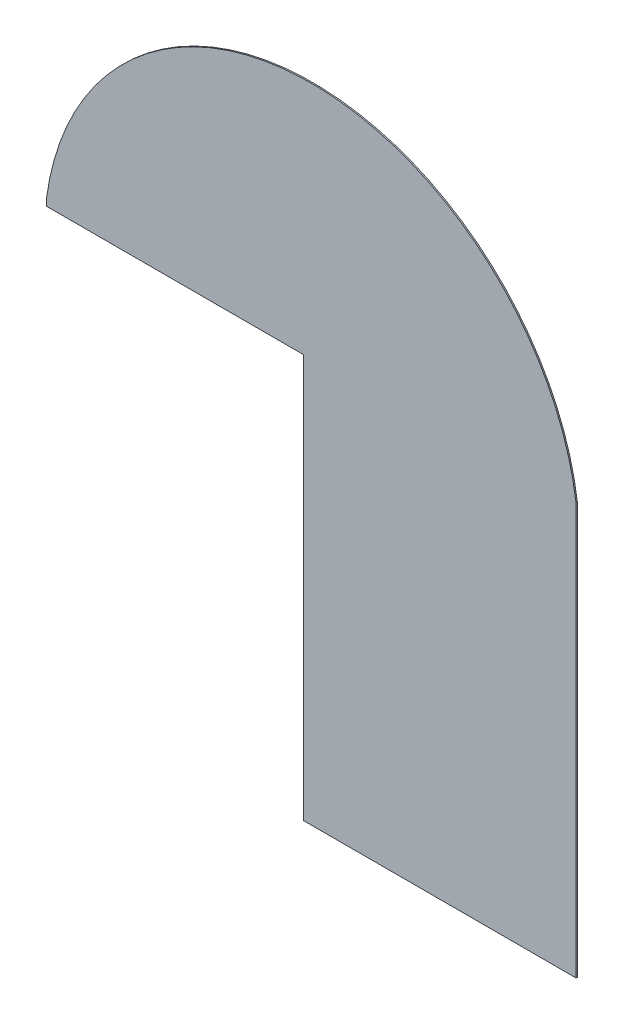
ISO-10303-21;
HEADER;
FILE_DESCRIPTION(('STEP AP214'),'2;1');
FILE_NAME('part.step','',(''),(''),'','','');
FILE_SCHEMA(('AUTOMOTIVE_DESIGN { 1 0 10303 214 1 1 1 1 }'));
ENDSEC;
DATA;
#1=APPLICATION_CONTEXT('core data for automotive mechanical design processes');
#2=APPLICATION_PROTOCOL_DEFINITION('international standard','automotive_design',2000,#1);
#3=PRODUCT_CONTEXT('',#1,'mechanical');
#4=PRODUCT('Part','Part','',(#3));
#5=PRODUCT_RELATED_PRODUCT_CATEGORY('part','',(#4));
#6=PRODUCT_DEFINITION_FORMATION('','',#4);
#7=PRODUCT_DEFINITION_CONTEXT('part definition',#1,'design');
#8=PRODUCT_DEFINITION('design','',#6,#7);
#9=PRODUCT_DEFINITION_SHAPE('','',#8);
#10=(LENGTH_UNIT() NAMED_UNIT(*) SI_UNIT(.MILLI.,.METRE.));
#11=(NAMED_UNIT(*) PLANE_ANGLE_UNIT() SI_UNIT($,.RADIAN.));
#12=(NAMED_UNIT(*) SI_UNIT($,.STERADIAN.) SOLID_ANGLE_UNIT());
#13=UNCERTAINTY_MEASURE_WITH_UNIT(LENGTH_MEASURE(1.E-05),#10,'distance_accuracy_value','');
#14=(GEOMETRIC_REPRESENTATION_CONTEXT(3) GLOBAL_UNCERTAINTY_ASSIGNED_CONTEXT((#13)) GLOBAL_UNIT_ASSIGNED_CONTEXT((#10,
#11,#12)) REPRESENTATION_CONTEXT('',''));
#15=CARTESIAN_POINT('',(0.,0.,0.));
#16=DIRECTION('',(0.,0.,1.));
#17=DIRECTION('',(1.,0.,0.));
#18=AXIS2_PLACEMENT_3D('',#15,#16,#17);
#19=CARTESIAN_POINT('',(-1030.,800.000000000001,2.5));
#20=DIRECTION('',(1.,0.,0.));
#21=DIRECTION('',(0.,0.,-1.));
#22=AXIS2_PLACEMENT_3D('',#19,#20,#21);
#23=PLANE('',#22);
#24=DIRECTION('',(0.,0.,1.));
#25=VECTOR('',#24,1.);
#26=CARTESIAN_POINT('',(-1030.,770.000000000001,-2.5));
#27=LINE('',#26,#25);
#28=CARTESIAN_POINT('',(-1030.,770.000000000001,-2.5));
#29=VERTEX_POINT('',#28);
#30=CARTESIAN_POINT('',(-1030.,770.000000000001,2.5));
#31=VERTEX_POINT('',#30);
#32=EDGE_CURVE('E101',#29,#31,#27,.T.);
#33=ORIENTED_EDGE('',*,*,#32,.T.);
#34=DIRECTION('',(0.,-1.,0.));
#35=VECTOR('',#34,1.);
#36=CARTESIAN_POINT('',(-1030.,800.000000000001,2.5));
#37=LINE('',#36,#35);
#38=CARTESIAN_POINT('',(-1030.,800.000000000001,2.5));
#39=VERTEX_POINT('',#38);
#40=EDGE_CURVE('E139',#39,#31,#37,.T.);
#41=ORIENTED_EDGE('',*,*,#40,.F.);
#42=DIRECTION('',(0.,0.,-1.));
#43=VECTOR('',#42,1.);
#44=CARTESIAN_POINT('',(-1030.,800.000000000001,2.5));
#45=LINE('',#44,#43);
#46=CARTESIAN_POINT('',(-1030.,800.000000000001,-2.5));
#47=VERTEX_POINT('',#46);
#48=EDGE_CURVE('E123',#39,#47,#45,.T.);
#49=ORIENTED_EDGE('',*,*,#48,.T.);
#50=DIRECTION('',(0.,-1.,0.));
#51=VECTOR('',#50,1.);
#52=CARTESIAN_POINT('',(-1030.,800.000000000001,-2.5));
#53=LINE('',#52,#51);
#54=EDGE_CURVE('E118',#47,#29,#53,.T.);
#55=ORIENTED_EDGE('',*,*,#54,.T.);
#56=EDGE_LOOP('',(#33,#41,#49,#55));
#57=FACE_BOUND('',#56,.T.);
#58=ADVANCED_FACE('F39',(#57),#23,.F.);
#59=CARTESIAN_POINT('',(1030.,-799.999999999999,2.5));
#60=DIRECTION('',(0.,1.,0.));
#61=DIRECTION('',(0.,0.,1.));
#62=AXIS2_PLACEMENT_3D('',#59,#60,#61);
#63=PLANE('',#62);
#64=DIRECTION('',(0.,0.,1.));
#65=VECTOR('',#64,1.);
#66=CARTESIAN_POINT('',(-29.9999999999997,-799.999999999999,-2.5));
#67=LINE('',#66,#65);
#68=CARTESIAN_POINT('',(-29.9999999999997,-799.999999999999,-2.5));
#69=VERTEX_POINT('',#68);
#70=CARTESIAN_POINT('',(-29.9999999999997,-799.999999999999,2.5));
#71=VERTEX_POINT('',#70);
#72=EDGE_CURVE('E112',#69,#71,#67,.T.);
#73=ORIENTED_EDGE('',*,*,#72,.F.);
#74=DIRECTION('',(1.,0.,0.));
#75=VECTOR('',#74,1.);
#76=CARTESIAN_POINT('',(1030.,-799.999999999999,-2.5));
#77=LINE('',#76,#75);
#78=CARTESIAN_POINT('',(1030.,-799.999999999999,-2.5));
#79=VERTEX_POINT('',#78);
#80=EDGE_CURVE('E125',#69,#79,#77,.T.);
#81=ORIENTED_EDGE('',*,*,#80,.T.);
#82=DIRECTION('',(0.,0.,-1.));
#83=VECTOR('',#82,1.);
#84=CARTESIAN_POINT('',(1030.,-799.999999999999,2.5));
#85=LINE('',#84,#83);
#86=CARTESIAN_POINT('',(1030.,-799.999999999999,2.5));
#87=VERTEX_POINT('',#86);
#88=EDGE_CURVE('E11',#87,#79,#85,.T.);
#89=ORIENTED_EDGE('',*,*,#88,.F.);
#90=DIRECTION('',(1.,0.,0.));
#91=VECTOR('',#90,1.);
#92=CARTESIAN_POINT('',(1030.,-799.999999999999,2.5));
#93=LINE('',#92,#91);
#94=EDGE_CURVE('E85',#71,#87,#93,.T.);
#95=ORIENTED_EDGE('',*,*,#94,.F.);
#96=EDGE_LOOP('',(#73,#81,#89,#95));
#97=FACE_BOUND('',#96,.T.);
#98=ADVANCED_FACE('F151',(#97),#63,.F.);
#99=CARTESIAN_POINT('',(0.,660.611111111113,2.5));
#100=DIRECTION('',(0.,0.,-1.));
#101=DIRECTION('',(-1.,0.,0.));
#102=AXIS2_PLACEMENT_3D('',#99,#100,#101);
#103=PLANE('',#102);
#104=DIRECTION('',(1.,0.,0.));
#105=VECTOR('',#104,1.);
#106=CARTESIAN_POINT('',(0.,770.000000000001,2.5));
#107=LINE('',#106,#105);
#108=CARTESIAN_POINT('',(-29.9999999999998,770.000000000001,2.5));
#109=VERTEX_POINT('',#108);
#110=EDGE_CURVE('E107',#31,#109,#107,.T.);
#111=ORIENTED_EDGE('',*,*,#110,.T.);
#112=DIRECTION('',(0.,-1.,0.));
#113=VECTOR('',#112,1.);
#114=CARTESIAN_POINT('',(-29.9999999999997,0.,2.5));
#115=LINE('',#114,#113);
#116=EDGE_CURVE('E121',#109,#71,#115,.T.);
#117=ORIENTED_EDGE('',*,*,#116,.T.);
#118=ORIENTED_EDGE('',*,*,#94,.T.);
#119=DIRECTION('',(0.,1.,0.));
#120=VECTOR('',#119,1.);
#121=CARTESIAN_POINT('',(1030.,800.000000000001,2.5));
#122=LINE('',#121,#120);
#123=CARTESIAN_POINT('',(1030.,800.000000000001,2.5));
#124=VERTEX_POINT('',#123);
#125=EDGE_CURVE('E148',#87,#124,#122,.T.);
#126=ORIENTED_EDGE('',*,*,#125,.T.);
#127=CARTESIAN_POINT('',(0.,660.611111111113,2.5));
#128=DIRECTION('',(0.,0.,1.));
#129=DIRECTION('',(-1.,0.,0.));
#130=AXIS2_PLACEMENT_3D('',#127,#128,#129);
#131=CIRCLE('',#130,1039.38888888889);
#132=EDGE_CURVE('E63',#124,#39,#131,.T.);
#133=ORIENTED_EDGE('',*,*,#132,.T.);
#134=ORIENTED_EDGE('',*,*,#40,.T.);
#135=EDGE_LOOP('',(#111,#117,#118,#126,#133,#134));
#136=FACE_BOUND('',#135,.T.);
#137=ADVANCED_FACE('F161',(#136),#103,.F.);
#138=CARTESIAN_POINT('',(0.,660.611111111113,-2.5));
#139=DIRECTION('',(0.,0.,-1.));
#140=DIRECTION('',(-1.,0.,0.));
#141=AXIS2_PLACEMENT_3D('',#138,#139,#140);
#142=PLANE('',#141);
#143=DIRECTION('',(0.,-1.,0.));
#144=VECTOR('',#143,1.);
#145=CARTESIAN_POINT('',(-29.9999999999997,0.,-2.5));
#146=LINE('',#145,#144);
#147=CARTESIAN_POINT('',(-29.9999999999998,770.000000000001,-2.5));
#148=VERTEX_POINT('',#147);
#149=EDGE_CURVE('E113',#148,#69,#146,.T.);
#150=ORIENTED_EDGE('',*,*,#149,.F.);
#151=DIRECTION('',(1.,0.,0.));
#152=VECTOR('',#151,1.);
#153=CARTESIAN_POINT('',(0.,770.000000000001,-2.5));
#154=LINE('',#153,#152);
#155=EDGE_CURVE('E104',#29,#148,#154,.T.);
#156=ORIENTED_EDGE('',*,*,#155,.F.);
#157=ORIENTED_EDGE('',*,*,#54,.F.);
#158=CARTESIAN_POINT('',(0.,660.611111111113,-2.5));
#159=DIRECTION('',(0.,0.,1.));
#160=DIRECTION('',(-1.,0.,0.));
#161=AXIS2_PLACEMENT_3D('',#158,#159,#160);
#162=CIRCLE('',#161,1039.38888888889);
#163=CARTESIAN_POINT('',(1030.,800.000000000001,-2.5));
#164=VERTEX_POINT('',#163);
#165=EDGE_CURVE('E80',#164,#47,#162,.T.);
#166=ORIENTED_EDGE('',*,*,#165,.F.);
#167=DIRECTION('',(0.,1.,0.));
#168=VECTOR('',#167,1.);
#169=CARTESIAN_POINT('',(1030.,800.000000000001,-2.5));
#170=LINE('',#169,#168);
#171=EDGE_CURVE('E129',#79,#164,#170,.T.);
#172=ORIENTED_EDGE('',*,*,#171,.F.);
#173=ORIENTED_EDGE('',*,*,#80,.F.);
#174=EDGE_LOOP('',(#150,#156,#157,#166,#172,#173));
#175=FACE_BOUND('',#174,.T.);
#176=ADVANCED_FACE('F117',(#175),#142,.T.);
#177=CARTESIAN_POINT('',(1030.,800.000000000001,2.5));
#178=DIRECTION('',(-1.,0.,0.));
#179=DIRECTION('',(0.,-1.,0.));
#180=AXIS2_PLACEMENT_3D('',#177,#178,#179);
#181=PLANE('',#180);
#182=ORIENTED_EDGE('',*,*,#171,.T.);
#183=DIRECTION('',(0.,0.,-1.));
#184=VECTOR('',#183,1.);
#185=CARTESIAN_POINT('',(1030.,800.000000000001,2.5));
#186=LINE('',#185,#184);
#187=EDGE_CURVE('E47',#124,#164,#186,.T.);
#188=ORIENTED_EDGE('',*,*,#187,.F.);
#189=ORIENTED_EDGE('',*,*,#125,.F.);
#190=ORIENTED_EDGE('',*,*,#88,.T.);
#191=EDGE_LOOP('',(#182,#188,#189,#190));
#192=FACE_BOUND('',#191,.T.);
#193=ADVANCED_FACE('F147',(#192),#181,.F.);
#194=CARTESIAN_POINT('',(0.,660.611111111113,2.5));
#195=DIRECTION('',(0.,0.,-1.));
#196=DIRECTION('',(-1.,0.,0.));
#197=AXIS2_PLACEMENT_3D('',#194,#195,#196);
#198=CYLINDRICAL_SURFACE('',#197,1039.38888888889);
#199=ORIENTED_EDGE('',*,*,#165,.T.);
#200=ORIENTED_EDGE('',*,*,#48,.F.);
#201=ORIENTED_EDGE('',*,*,#132,.F.);
#202=ORIENTED_EDGE('',*,*,#187,.T.);
#203=EDGE_LOOP('',(#199,#200,#201,#202));
#204=FACE_BOUND('',#203,.T.);
#205=ADVANCED_FACE('F143',(#204),#198,.T.);
#206=CARTESIAN_POINT('',(0.,770.000000000001,-2.5));
#207=DIRECTION('',(0.,-1.,0.));
#208=DIRECTION('',(0.,0.,-1.));
#209=AXIS2_PLACEMENT_3D('',#206,#207,#208);
#210=PLANE('',#209);
#211=ORIENTED_EDGE('',*,*,#110,.F.);
#212=ORIENTED_EDGE('',*,*,#32,.F.);
#213=ORIENTED_EDGE('',*,*,#155,.T.);
#214=DIRECTION('',(0.,0.,1.));
#215=VECTOR('',#214,1.);
#216=CARTESIAN_POINT('',(-29.9999999999998,770.000000000001,-2.5));
#217=LINE('',#216,#215);
#218=EDGE_CURVE('E54',#148,#109,#217,.T.);
#219=ORIENTED_EDGE('',*,*,#218,.T.);
#220=EDGE_LOOP('',(#211,#212,#213,#219));
#221=FACE_BOUND('',#220,.T.);
#222=ADVANCED_FACE('F103',(#221),#210,.T.);
#223=CARTESIAN_POINT('',(-29.9999999999997,0.,-2.5));
#224=DIRECTION('',(-1.,0.,0.));
#225=DIRECTION('',(0.,-1.,0.));
#226=AXIS2_PLACEMENT_3D('',#223,#224,#225);
#227=PLANE('',#226);
#228=ORIENTED_EDGE('',*,*,#116,.F.);
#229=ORIENTED_EDGE('',*,*,#218,.F.);
#230=ORIENTED_EDGE('',*,*,#149,.T.);
#231=ORIENTED_EDGE('',*,*,#72,.T.);
#232=EDGE_LOOP('',(#228,#229,#230,#231));
#233=FACE_BOUND('',#232,.T.);
#234=ADVANCED_FACE('F199',(#233),#227,.T.);
#235=CLOSED_SHELL('',(#58,#98,#137,#176,#193,#205,#222,#234));
#236=MANIFOLD_SOLID_BREP('B2',#235);
#237=ADVANCED_BREP_SHAPE_REPRESENTATION('',(#18,#236),#14);
#238=SHAPE_DEFINITION_REPRESENTATION(#9,#237);
ENDSEC;
END-ISO-10303-21;
